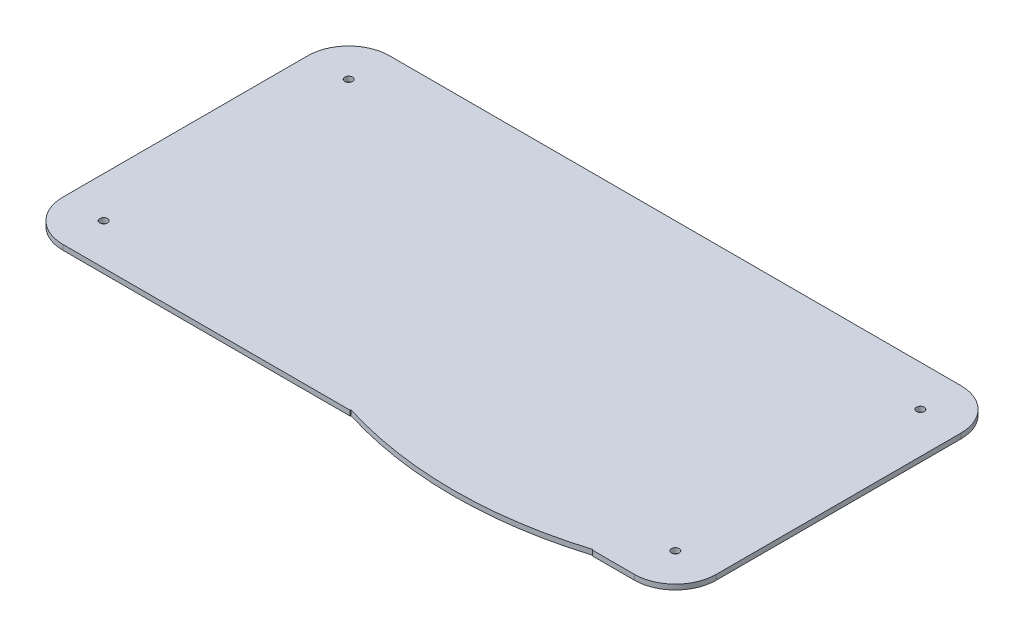
ISO-10303-21;
HEADER;
FILE_DESCRIPTION(('STEP AP214'),'2;1');
FILE_NAME('part.step','',(''),(''),'','','');
FILE_SCHEMA(('AUTOMOTIVE_DESIGN { 1 0 10303 214 1 1 1 1 }'));
ENDSEC;
DATA;
#1=APPLICATION_CONTEXT('core data for automotive mechanical design processes');
#2=APPLICATION_PROTOCOL_DEFINITION('international standard','automotive_design',2000,#1);
#3=PRODUCT_CONTEXT('',#1,'mechanical');
#4=PRODUCT('Part','Part','',(#3));
#5=PRODUCT_RELATED_PRODUCT_CATEGORY('part','',(#4));
#6=PRODUCT_DEFINITION_FORMATION('','',#4);
#7=PRODUCT_DEFINITION_CONTEXT('part definition',#1,'design');
#8=PRODUCT_DEFINITION('design','',#6,#7);
#9=PRODUCT_DEFINITION_SHAPE('','',#8);
#10=(LENGTH_UNIT() NAMED_UNIT(*) SI_UNIT(.MILLI.,.METRE.));
#11=(NAMED_UNIT(*) PLANE_ANGLE_UNIT() SI_UNIT($,.RADIAN.));
#12=(NAMED_UNIT(*) SI_UNIT($,.STERADIAN.) SOLID_ANGLE_UNIT());
#13=UNCERTAINTY_MEASURE_WITH_UNIT(LENGTH_MEASURE(1.E-05),#10,'distance_accuracy_value','');
#14=(GEOMETRIC_REPRESENTATION_CONTEXT(3) GLOBAL_UNCERTAINTY_ASSIGNED_CONTEXT((#13)) GLOBAL_UNIT_ASSIGNED_CONTEXT((#10,
#11,#12)) REPRESENTATION_CONTEXT('',''));
#15=CARTESIAN_POINT('',(0.,0.,0.));
#16=DIRECTION('',(0.,0.,1.));
#17=DIRECTION('',(1.,0.,0.));
#18=AXIS2_PLACEMENT_3D('',#15,#16,#17);
#19=CARTESIAN_POINT('',(-177.8,472.44,-25.4));
#20=DIRECTION('',(0.,1.,0.));
#21=DIRECTION('',(0.,0.,1.));
#22=AXIS2_PLACEMENT_3D('',#19,#20,#21);
#23=CYLINDRICAL_SURFACE('',#22,25.4);
#24=CARTESIAN_POINT('',(-177.8,478.79,-25.4));
#25=DIRECTION('',(0.,1.,0.));
#26=DIRECTION('',(0.,0.,1.));
#27=AXIS2_PLACEMENT_3D('',#24,#25,#26);
#28=CIRCLE('',#27,25.4);
#29=CARTESIAN_POINT('',(-203.2,478.79,-25.4));
#30=VERTEX_POINT('',#29);
#31=CARTESIAN_POINT('',(-177.8,478.79,0.));
#32=VERTEX_POINT('',#31);
#33=EDGE_CURVE('E180',#30,#32,#28,.T.);
#34=ORIENTED_EDGE('',*,*,#33,.F.);
#35=DIRECTION('',(0.,1.,0.));
#36=VECTOR('',#35,1.);
#37=CARTESIAN_POINT('',(-203.2,472.44,-25.4));
#38=LINE('',#37,#36);
#39=CARTESIAN_POINT('',(-203.2,475.615,-25.4));
#40=VERTEX_POINT('',#39);
#41=EDGE_CURVE('E202',#40,#30,#38,.T.);
#42=ORIENTED_EDGE('',*,*,#41,.F.);
#43=CARTESIAN_POINT('',(-177.8,475.615,-25.4));
#44=DIRECTION('',(0.,1.,0.));
#45=DIRECTION('',(0.,0.,1.));
#46=AXIS2_PLACEMENT_3D('',#43,#44,#45);
#47=CIRCLE('',#46,25.4);
#48=CARTESIAN_POINT('',(-177.8,475.615,0.));
#49=VERTEX_POINT('',#48);
#50=EDGE_CURVE('E201',#40,#49,#47,.T.);
#51=ORIENTED_EDGE('',*,*,#50,.T.);
#52=DIRECTION('',(0.,1.,0.));
#53=VECTOR('',#52,1.);
#54=CARTESIAN_POINT('',(-177.8,472.44,0.));
#55=LINE('',#54,#53);
#56=EDGE_CURVE('E215',#49,#32,#55,.T.);
#57=ORIENTED_EDGE('',*,*,#56,.T.);
#58=EDGE_LOOP('',(#34,#42,#51,#57));
#59=FACE_BOUND('',#58,.T.);
#60=ADVANCED_FACE('F36',(#59),#23,.T.);
#61=CARTESIAN_POINT('',(-203.2,472.44,-177.8));
#62=DIRECTION('',(-1.,0.,0.));
#63=DIRECTION('',(0.,0.,1.));
#64=AXIS2_PLACEMENT_3D('',#61,#62,#63);
#65=PLANE('',#64);
#66=DIRECTION('',(0.,0.,1.));
#67=VECTOR('',#66,1.);
#68=CARTESIAN_POINT('',(-203.2,478.79,-177.8));
#69=LINE('',#68,#67);
#70=CARTESIAN_POINT('',(-203.2,478.79,-177.8));
#71=VERTEX_POINT('',#70);
#72=EDGE_CURVE('E198',#71,#30,#69,.T.);
#73=ORIENTED_EDGE('',*,*,#72,.F.);
#74=DIRECTION('',(0.,1.,0.));
#75=VECTOR('',#74,1.);
#76=CARTESIAN_POINT('',(-203.2,472.44,-177.8));
#77=LINE('',#76,#75);
#78=CARTESIAN_POINT('',(-203.2,475.615,-177.8));
#79=VERTEX_POINT('',#78);
#80=EDGE_CURVE('E204',#79,#71,#77,.T.);
#81=ORIENTED_EDGE('',*,*,#80,.F.);
#82=DIRECTION('',(0.,0.,1.));
#83=VECTOR('',#82,1.);
#84=CARTESIAN_POINT('',(-203.2,475.615,-25.4));
#85=LINE('',#84,#83);
#86=EDGE_CURVE('E217',#79,#40,#85,.T.);
#87=ORIENTED_EDGE('',*,*,#86,.T.);
#88=ORIENTED_EDGE('',*,*,#41,.T.);
#89=EDGE_LOOP('',(#73,#81,#87,#88));
#90=FACE_BOUND('',#89,.T.);
#91=ADVANCED_FACE('F276',(#90),#65,.T.);
#92=CARTESIAN_POINT('',(-177.8,472.44,-177.8));
#93=DIRECTION('',(0.,1.,0.));
#94=DIRECTION('',(0.,0.,1.));
#95=AXIS2_PLACEMENT_3D('',#92,#93,#94);
#96=CYLINDRICAL_SURFACE('',#95,25.4);
#97=CARTESIAN_POINT('',(-177.8,478.79,-177.8));
#98=DIRECTION('',(0.,1.,0.));
#99=DIRECTION('',(0.,0.,1.));
#100=AXIS2_PLACEMENT_3D('',#97,#98,#99);
#101=CIRCLE('',#100,25.4);
#102=CARTESIAN_POINT('',(-177.8,478.79,-203.2));
#103=VERTEX_POINT('',#102);
#104=EDGE_CURVE('E195',#103,#71,#101,.T.);
#105=ORIENTED_EDGE('',*,*,#104,.F.);
#106=DIRECTION('',(0.,1.,0.));
#107=VECTOR('',#106,1.);
#108=CARTESIAN_POINT('',(-177.8,472.44,-203.2));
#109=LINE('',#108,#107);
#110=CARTESIAN_POINT('',(-177.8,475.615,-203.2));
#111=VERTEX_POINT('',#110);
#112=EDGE_CURVE('E206',#111,#103,#109,.T.);
#113=ORIENTED_EDGE('',*,*,#112,.F.);
#114=CARTESIAN_POINT('',(-177.8,475.615,-177.8));
#115=DIRECTION('',(0.,1.,0.));
#116=DIRECTION('',(0.,0.,1.));
#117=AXIS2_PLACEMENT_3D('',#114,#115,#116);
#118=CIRCLE('',#117,25.4);
#119=EDGE_CURVE('E218',#111,#79,#118,.T.);
#120=ORIENTED_EDGE('',*,*,#119,.T.);
#121=ORIENTED_EDGE('',*,*,#80,.T.);
#122=EDGE_LOOP('',(#105,#113,#120,#121));
#123=FACE_BOUND('',#122,.T.);
#124=ADVANCED_FACE('F280',(#123),#96,.T.);
#125=CARTESIAN_POINT('',(177.8,472.44,-203.2));
#126=DIRECTION('',(0.,0.,-1.));
#127=DIRECTION('',(-1.,0.,0.));
#128=AXIS2_PLACEMENT_3D('',#125,#126,#127);
#129=PLANE('',#128);
#130=DIRECTION('',(-1.,0.,0.));
#131=VECTOR('',#130,1.);
#132=CARTESIAN_POINT('',(177.8,478.79,-203.2));
#133=LINE('',#132,#131);
#134=CARTESIAN_POINT('',(177.8,478.79,-203.2));
#135=VERTEX_POINT('',#134);
#136=EDGE_CURVE('E192',#135,#103,#133,.T.);
#137=ORIENTED_EDGE('',*,*,#136,.F.);
#138=DIRECTION('',(0.,1.,0.));
#139=VECTOR('',#138,1.);
#140=CARTESIAN_POINT('',(177.8,472.44,-203.2));
#141=LINE('',#140,#139);
#142=CARTESIAN_POINT('',(177.8,475.615,-203.2));
#143=VERTEX_POINT('',#142);
#144=EDGE_CURVE('E208',#143,#135,#141,.T.);
#145=ORIENTED_EDGE('',*,*,#144,.F.);
#146=DIRECTION('',(-1.,0.,0.));
#147=VECTOR('',#146,1.);
#148=CARTESIAN_POINT('',(-177.8,475.615,-203.2));
#149=LINE('',#148,#147);
#150=EDGE_CURVE('E221',#143,#111,#149,.T.);
#151=ORIENTED_EDGE('',*,*,#150,.T.);
#152=ORIENTED_EDGE('',*,*,#112,.T.);
#153=EDGE_LOOP('',(#137,#145,#151,#152));
#154=FACE_BOUND('',#153,.T.);
#155=ADVANCED_FACE('F270',(#154),#129,.T.);
#156=CARTESIAN_POINT('',(177.8,472.44,-177.8));
#157=DIRECTION('',(0.,1.,0.));
#158=DIRECTION('',(0.,0.,1.));
#159=AXIS2_PLACEMENT_3D('',#156,#157,#158);
#160=CYLINDRICAL_SURFACE('',#159,25.4);
#161=CARTESIAN_POINT('',(177.8,478.79,-177.8));
#162=DIRECTION('',(0.,1.,0.));
#163=DIRECTION('',(0.,0.,1.));
#164=AXIS2_PLACEMENT_3D('',#161,#162,#163);
#165=CIRCLE('',#164,25.4);
#166=CARTESIAN_POINT('',(203.2,478.79,-177.8));
#167=VERTEX_POINT('',#166);
#168=EDGE_CURVE('E189',#167,#135,#165,.T.);
#169=ORIENTED_EDGE('',*,*,#168,.F.);
#170=DIRECTION('',(0.,1.,0.));
#171=VECTOR('',#170,1.);
#172=CARTESIAN_POINT('',(203.2,472.44,-177.8));
#173=LINE('',#172,#171);
#174=CARTESIAN_POINT('',(203.2,475.615,-177.8));
#175=VERTEX_POINT('',#174);
#176=EDGE_CURVE('E210',#175,#167,#173,.T.);
#177=ORIENTED_EDGE('',*,*,#176,.F.);
#178=CARTESIAN_POINT('',(177.8,475.615,-177.8));
#179=DIRECTION('',(0.,1.,0.));
#180=DIRECTION('',(0.,0.,1.));
#181=AXIS2_PLACEMENT_3D('',#178,#179,#180);
#182=CIRCLE('',#181,25.4);
#183=EDGE_CURVE('E235',#175,#143,#182,.T.);
#184=ORIENTED_EDGE('',*,*,#183,.T.);
#185=ORIENTED_EDGE('',*,*,#144,.T.);
#186=EDGE_LOOP('',(#169,#177,#184,#185));
#187=FACE_BOUND('',#186,.T.);
#188=ADVANCED_FACE('F266',(#187),#160,.T.);
#189=CARTESIAN_POINT('',(203.2,472.44,-25.4));
#190=DIRECTION('',(1.,0.,0.));
#191=DIRECTION('',(0.,0.,-1.));
#192=AXIS2_PLACEMENT_3D('',#189,#190,#191);
#193=PLANE('',#192);
#194=DIRECTION('',(0.,0.,-1.));
#195=VECTOR('',#194,1.);
#196=CARTESIAN_POINT('',(203.2,478.79,-25.4));
#197=LINE('',#196,#195);
#198=CARTESIAN_POINT('',(203.2,478.79,-25.4));
#199=VERTEX_POINT('',#198);
#200=EDGE_CURVE('E186',#199,#167,#197,.T.);
#201=ORIENTED_EDGE('',*,*,#200,.F.);
#202=DIRECTION('',(0.,1.,0.));
#203=VECTOR('',#202,1.);
#204=CARTESIAN_POINT('',(203.2,472.44,-25.4));
#205=LINE('',#204,#203);
#206=CARTESIAN_POINT('',(203.2,475.615,-25.4));
#207=VERTEX_POINT('',#206);
#208=EDGE_CURVE('E212',#207,#199,#205,.T.);
#209=ORIENTED_EDGE('',*,*,#208,.F.);
#210=DIRECTION('',(0.,0.,-1.));
#211=VECTOR('',#210,1.);
#212=CARTESIAN_POINT('',(203.2,475.615,-25.3999999999999));
#213=LINE('',#212,#211);
#214=EDGE_CURVE('E232',#207,#175,#213,.T.);
#215=ORIENTED_EDGE('',*,*,#214,.T.);
#216=ORIENTED_EDGE('',*,*,#176,.T.);
#217=EDGE_LOOP('',(#201,#209,#215,#216));
#218=FACE_BOUND('',#217,.T.);
#219=ADVANCED_FACE('F263',(#218),#193,.T.);
#220=CARTESIAN_POINT('',(177.8,472.44,-25.4));
#221=DIRECTION('',(0.,1.,0.));
#222=DIRECTION('',(0.,0.,1.));
#223=AXIS2_PLACEMENT_3D('',#220,#221,#222);
#224=CYLINDRICAL_SURFACE('',#223,25.4);
#225=CARTESIAN_POINT('',(177.8,478.79,-25.4));
#226=DIRECTION('',(0.,1.,0.));
#227=DIRECTION('',(0.,0.,1.));
#228=AXIS2_PLACEMENT_3D('',#225,#226,#227);
#229=CIRCLE('',#228,25.4);
#230=CARTESIAN_POINT('',(177.8,478.79,0.));
#231=VERTEX_POINT('',#230);
#232=EDGE_CURVE('E140',#231,#199,#229,.T.);
#233=ORIENTED_EDGE('',*,*,#232,.F.);
#234=DIRECTION('',(0.,1.,0.));
#235=VECTOR('',#234,1.);
#236=CARTESIAN_POINT('',(177.8,472.44,0.));
#237=LINE('',#236,#235);
#238=CARTESIAN_POINT('',(177.8,475.615,0.));
#239=VERTEX_POINT('',#238);
#240=EDGE_CURVE('E138',#239,#231,#237,.T.);
#241=ORIENTED_EDGE('',*,*,#240,.F.);
#242=CARTESIAN_POINT('',(177.8,475.615,-25.4));
#243=DIRECTION('',(0.,1.,0.));
#244=DIRECTION('',(0.,0.,1.));
#245=AXIS2_PLACEMENT_3D('',#242,#243,#244);
#246=CIRCLE('',#245,25.4);
#247=EDGE_CURVE('E229',#239,#207,#246,.T.);
#248=ORIENTED_EDGE('',*,*,#247,.T.);
#249=ORIENTED_EDGE('',*,*,#208,.T.);
#250=EDGE_LOOP('',(#233,#241,#248,#249));
#251=FACE_BOUND('',#250,.T.);
#252=ADVANCED_FACE('F259',(#251),#224,.T.);
#253=CARTESIAN_POINT('',(152.4,472.44,0.));
#254=DIRECTION('',(0.,0.,1.));
#255=DIRECTION('',(1.,0.,0.));
#256=AXIS2_PLACEMENT_3D('',#253,#254,#255);
#257=PLANE('',#256);
#258=DIRECTION('',(1.,0.,0.));
#259=VECTOR('',#258,1.);
#260=CARTESIAN_POINT('',(152.4,475.615,0.));
#261=LINE('',#260,#259);
#262=CARTESIAN_POINT('',(151.583380091741,475.615,0.));
#263=VERTEX_POINT('',#262);
#264=EDGE_CURVE('E228',#263,#239,#261,.T.);
#265=ORIENTED_EDGE('',*,*,#264,.T.);
#266=ORIENTED_EDGE('',*,*,#240,.T.);
#267=DIRECTION('',(1.,0.,0.));
#268=VECTOR('',#267,1.);
#269=CARTESIAN_POINT('',(-177.8,478.79,0.));
#270=LINE('',#269,#268);
#271=CARTESIAN_POINT('',(151.583380091741,478.79,0.));
#272=VERTEX_POINT('',#271);
#273=EDGE_CURVE('E127',#272,#231,#270,.T.);
#274=ORIENTED_EDGE('',*,*,#273,.F.);
#275=DIRECTION('',(0.,1.,0.));
#276=VECTOR('',#275,1.);
#277=CARTESIAN_POINT('',(151.583380091741,472.824934620479,0.));
#278=LINE('',#277,#276);
#279=EDGE_CURVE('E132',#263,#272,#278,.T.);
#280=ORIENTED_EDGE('',*,*,#279,.F.);
#281=EDGE_LOOP('',(#265,#266,#274,#280));
#282=FACE_BOUND('',#281,.T.);
#283=ADVANCED_FACE('F136',(#282),#257,.T.);
#284=CARTESIAN_POINT('',(-177.8,472.44,0.));
#285=DIRECTION('',(0.,0.,1.));
#286=DIRECTION('',(1.,0.,0.));
#287=AXIS2_PLACEMENT_3D('',#284,#285,#286);
#288=PLANE('',#287);
#289=DIRECTION('',(1.,0.,0.));
#290=VECTOR('',#289,1.);
#291=CARTESIAN_POINT('',(-177.8,475.615,0.));
#292=LINE('',#291,#290);
#293=CARTESIAN_POINT('',(0.80427456169157,475.615,0.));
#294=VERTEX_POINT('',#293);
#295=EDGE_CURVE('E226',#49,#294,#292,.T.);
#296=ORIENTED_EDGE('',*,*,#295,.T.);
#297=DIRECTION('',(0.,1.,0.));
#298=VECTOR('',#297,1.);
#299=CARTESIAN_POINT('',(0.80427456169157,472.824934620479,0.));
#300=LINE('',#299,#298);
#301=CARTESIAN_POINT('',(0.80427456169157,478.79,0.));
#302=VERTEX_POINT('',#301);
#303=EDGE_CURVE('E153',#294,#302,#300,.T.);
#304=ORIENTED_EDGE('',*,*,#303,.T.);
#305=DIRECTION('',(1.,0.,0.));
#306=VECTOR('',#305,1.);
#307=CARTESIAN_POINT('',(-177.8,478.79,0.));
#308=LINE('',#307,#306);
#309=EDGE_CURVE('E141',#32,#302,#308,.T.);
#310=ORIENTED_EDGE('',*,*,#309,.F.);
#311=ORIENTED_EDGE('',*,*,#56,.F.);
#312=EDGE_LOOP('',(#296,#304,#310,#311));
#313=FACE_BOUND('',#312,.T.);
#314=ADVANCED_FACE('F250',(#313),#288,.T.);
#315=CARTESIAN_POINT('',(-177.8,475.615,-25.4));
#316=DIRECTION('',(0.,1.,0.));
#317=DIRECTION('',(0.,0.,1.));
#318=AXIS2_PLACEMENT_3D('',#315,#316,#317);
#319=PLANE('',#318);
#320=DIRECTION('',(-0.297114446103736,0.,-0.954841874823507));
#321=VECTOR('',#320,1.);
#322=CARTESIAN_POINT('',(151.201921547921,475.615,-1.22589997196476));
#323=LINE('',#322,#321);
#324=CARTESIAN_POINT('',(151.429412484423,475.615,-0.494808383642659));
#325=VERTEX_POINT('',#324);
#326=EDGE_CURVE('E144',#263,#325,#323,.T.);
#327=ORIENTED_EDGE('',*,*,#326,.T.);
#328=CARTESIAN_POINT('',(76.2,475.615,-242.300557159904));
#329=DIRECTION('',(0.,1.,0.));
#330=DIRECTION('',(0.,0.,1.));
#331=AXIS2_PLACEMENT_3D('',#328,#329,#330);
#332=CIRCLE('',#331,253.238);
#333=CARTESIAN_POINT('',(0.959331897580934,475.615,-0.498310463349333));
#334=VERTEX_POINT('',#333);
#335=EDGE_CURVE('E183',#325,#334,#332,.F.);
#336=ORIENTED_EDGE('',*,*,#335,.T.);
#337=DIRECTION('',(-0.29711444610374,0.,0.954841874823506));
#338=VECTOR('',#337,1.);
#339=CARTESIAN_POINT('',(1.18573310551195,475.615,-1.22589997196476));
#340=LINE('',#339,#338);
#341=EDGE_CURVE('E149',#334,#294,#340,.T.);
#342=ORIENTED_EDGE('',*,*,#341,.T.);
#343=ORIENTED_EDGE('',*,*,#295,.F.);
#344=ORIENTED_EDGE('',*,*,#50,.F.);
#345=ORIENTED_EDGE('',*,*,#86,.F.);
#346=ORIENTED_EDGE('',*,*,#119,.F.);
#347=ORIENTED_EDGE('',*,*,#150,.F.);
#348=ORIENTED_EDGE('',*,*,#183,.F.);
#349=ORIENTED_EDGE('',*,*,#214,.F.);
#350=ORIENTED_EDGE('',*,*,#247,.F.);
#351=ORIENTED_EDGE('',*,*,#264,.F.);
#352=EDGE_LOOP('',(#327,#336,#342,#343,#344,#345,#346,#347,#348,#349,#350,#351));
#353=FACE_BOUND('',#352,.T.);
#354=CARTESIAN_POINT('',(177.8,475.615,-25.4));
#355=DIRECTION('',(0.,1.,0.));
#356=DIRECTION('',(0.,0.,1.));
#357=AXIS2_PLACEMENT_3D('',#354,#355,#356);
#358=CIRCLE('',#357,2.413);
#359=CARTESIAN_POINT('',(177.8,475.615,-22.987));
#360=VERTEX_POINT('',#359);
#361=EDGE_CURVE('E159',#360,#360,#358,.T.);
#362=ORIENTED_EDGE('',*,*,#361,.T.);
#363=EDGE_LOOP('',(#362));
#364=FACE_BOUND('',#363,.T.);
#365=CARTESIAN_POINT('',(177.8,475.615,-177.8));
#366=DIRECTION('',(0.,1.,0.));
#367=DIRECTION('',(0.,0.,1.));
#368=AXIS2_PLACEMENT_3D('',#365,#366,#367);
#369=CIRCLE('',#368,2.413);
#370=CARTESIAN_POINT('',(177.8,475.615,-175.387));
#371=VERTEX_POINT('',#370);
#372=EDGE_CURVE('E165',#371,#371,#369,.T.);
#373=ORIENTED_EDGE('',*,*,#372,.T.);
#374=EDGE_LOOP('',(#373));
#375=FACE_BOUND('',#374,.T.);
#376=CARTESIAN_POINT('',(-177.8,475.615,-25.4));
#377=DIRECTION('',(0.,1.,0.));
#378=DIRECTION('',(0.,0.,1.));
#379=AXIS2_PLACEMENT_3D('',#376,#377,#378);
#380=CIRCLE('',#379,2.413);
#381=CARTESIAN_POINT('',(-177.8,475.615,-22.987));
#382=VERTEX_POINT('',#381);
#383=EDGE_CURVE('E171',#382,#382,#380,.T.);
#384=ORIENTED_EDGE('',*,*,#383,.T.);
#385=EDGE_LOOP('',(#384));
#386=FACE_BOUND('',#385,.T.);
#387=CARTESIAN_POINT('',(-177.8,475.615,-177.8));
#388=DIRECTION('',(0.,1.,0.));
#389=DIRECTION('',(0.,0.,1.));
#390=AXIS2_PLACEMENT_3D('',#387,#388,#389);
#391=CIRCLE('',#390,2.413);
#392=CARTESIAN_POINT('',(-177.8,475.615,-175.387));
#393=VERTEX_POINT('',#392);
#394=EDGE_CURVE('E177',#393,#393,#391,.T.);
#395=ORIENTED_EDGE('',*,*,#394,.T.);
#396=EDGE_LOOP('',(#395));
#397=FACE_BOUND('',#396,.T.);
#398=ADVANCED_FACE('F254',(#353,#364,#375,#386,#397),#319,.F.);
#399=CARTESIAN_POINT('',(-177.8,478.79,-25.4));
#400=DIRECTION('',(0.,1.,0.));
#401=DIRECTION('',(0.,0.,1.));
#402=AXIS2_PLACEMENT_3D('',#399,#400,#401);
#403=PLANE('',#402);
#404=CARTESIAN_POINT('',(76.2,478.79,-242.300557159904));
#405=DIRECTION('',(0.,1.,0.));
#406=DIRECTION('',(0.,0.,1.));
#407=AXIS2_PLACEMENT_3D('',#404,#405,#406);
#408=CIRCLE('',#407,253.238);
#409=CARTESIAN_POINT('',(151.429412484423,478.79,-0.494808383642686));
#410=VERTEX_POINT('',#409);
#411=CARTESIAN_POINT('',(0.95933189758092,478.79,-0.498310463349305));
#412=VERTEX_POINT('',#411);
#413=EDGE_CURVE('E130',#410,#412,#408,.F.);
#414=ORIENTED_EDGE('',*,*,#413,.F.);
#415=DIRECTION('',(0.297114446103736,0.,0.954841874823507));
#416=VECTOR('',#415,1.);
#417=CARTESIAN_POINT('',(151.201921547921,478.79,-1.22589997196476));
#418=LINE('',#417,#416);
#419=EDGE_CURVE('E122',#410,#272,#418,.T.);
#420=ORIENTED_EDGE('',*,*,#419,.T.);
#421=ORIENTED_EDGE('',*,*,#273,.T.);
#422=ORIENTED_EDGE('',*,*,#232,.T.);
#423=ORIENTED_EDGE('',*,*,#200,.T.);
#424=ORIENTED_EDGE('',*,*,#168,.T.);
#425=ORIENTED_EDGE('',*,*,#136,.T.);
#426=ORIENTED_EDGE('',*,*,#104,.T.);
#427=ORIENTED_EDGE('',*,*,#72,.T.);
#428=ORIENTED_EDGE('',*,*,#33,.T.);
#429=ORIENTED_EDGE('',*,*,#309,.T.);
#430=DIRECTION('',(0.29711444610374,0.,-0.954841874823506));
#431=VECTOR('',#430,1.);
#432=CARTESIAN_POINT('',(1.18573310551195,478.79,-1.22589997196476));
#433=LINE('',#432,#431);
#434=EDGE_CURVE('E146',#302,#412,#433,.T.);
#435=ORIENTED_EDGE('',*,*,#434,.T.);
#436=EDGE_LOOP('',(#414,#420,#421,#422,#423,#424,#425,#426,#427,#428,#429,#435));
#437=FACE_BOUND('',#436,.T.);
#438=CARTESIAN_POINT('',(177.8,478.79,-25.4));
#439=DIRECTION('',(0.,1.,0.));
#440=DIRECTION('',(0.,0.,1.));
#441=AXIS2_PLACEMENT_3D('',#438,#439,#440);
#442=CIRCLE('',#441,2.413);
#443=CARTESIAN_POINT('',(177.8,478.79,-22.987));
#444=VERTEX_POINT('',#443);
#445=EDGE_CURVE('E152',#444,#444,#442,.T.);
#446=ORIENTED_EDGE('',*,*,#445,.F.);
#447=EDGE_LOOP('',(#446));
#448=FACE_BOUND('',#447,.T.);
#449=CARTESIAN_POINT('',(177.8,478.79,-177.8));
#450=DIRECTION('',(0.,1.,0.));
#451=DIRECTION('',(0.,0.,1.));
#452=AXIS2_PLACEMENT_3D('',#449,#450,#451);
#453=CIRCLE('',#452,2.413);
#454=CARTESIAN_POINT('',(177.8,478.79,-175.387));
#455=VERTEX_POINT('',#454);
#456=EDGE_CURVE('E162',#455,#455,#453,.T.);
#457=ORIENTED_EDGE('',*,*,#456,.F.);
#458=EDGE_LOOP('',(#457));
#459=FACE_BOUND('',#458,.T.);
#460=CARTESIAN_POINT('',(-177.8,478.79,-25.4));
#461=DIRECTION('',(0.,1.,0.));
#462=DIRECTION('',(0.,0.,1.));
#463=AXIS2_PLACEMENT_3D('',#460,#461,#462);
#464=CIRCLE('',#463,2.413);
#465=CARTESIAN_POINT('',(-177.8,478.79,-22.987));
#466=VERTEX_POINT('',#465);
#467=EDGE_CURVE('E168',#466,#466,#464,.T.);
#468=ORIENTED_EDGE('',*,*,#467,.F.);
#469=EDGE_LOOP('',(#468));
#470=FACE_BOUND('',#469,.T.);
#471=CARTESIAN_POINT('',(-177.8,478.79,-177.8));
#472=DIRECTION('',(0.,1.,0.));
#473=DIRECTION('',(0.,0.,1.));
#474=AXIS2_PLACEMENT_3D('',#471,#472,#473);
#475=CIRCLE('',#474,2.413);
#476=CARTESIAN_POINT('',(-177.8,478.79,-175.387));
#477=VERTEX_POINT('',#476);
#478=EDGE_CURVE('E174',#477,#477,#475,.T.);
#479=ORIENTED_EDGE('',*,*,#478,.F.);
#480=EDGE_LOOP('',(#479));
#481=FACE_BOUND('',#480,.T.);
#482=ADVANCED_FACE('F124',(#437,#448,#459,#470,#481),#403,.T.);
#483=CARTESIAN_POINT('',(76.2,471.17,-242.300557159904));
#484=DIRECTION('',(0.,1.,0.));
#485=DIRECTION('',(0.,0.,1.));
#486=AXIS2_PLACEMENT_3D('',#483,#484,#485);
#487=CYLINDRICAL_SURFACE('',#486,253.238);
#488=ORIENTED_EDGE('',*,*,#335,.F.);
#489=DIRECTION('',(0.,1.,0.));
#490=VECTOR('',#489,1.);
#491=CARTESIAN_POINT('',(151.429412484423,471.17,-0.494808383642714));
#492=LINE('',#491,#490);
#493=EDGE_CURVE('E12',#325,#410,#492,.T.);
#494=ORIENTED_EDGE('',*,*,#493,.T.);
#495=ORIENTED_EDGE('',*,*,#413,.T.);
#496=DIRECTION('',(0.,1.,0.));
#497=VECTOR('',#496,1.);
#498=CARTESIAN_POINT('',(0.95933189758092,471.17,-0.498310463349333));
#499=LINE('',#498,#497);
#500=EDGE_CURVE('E44',#412,#334,#499,.F.);
#501=ORIENTED_EDGE('',*,*,#500,.T.);
#502=EDGE_LOOP('',(#488,#494,#495,#501));
#503=FACE_BOUND('',#502,.T.);
#504=ADVANCED_FACE('F38',(#503),#487,.T.);
#505=CARTESIAN_POINT('',(-177.8,468.63,-177.8));
#506=DIRECTION('',(0.,1.,0.));
#507=DIRECTION('',(0.,0.,1.));
#508=AXIS2_PLACEMENT_3D('',#505,#506,#507);
#509=CYLINDRICAL_SURFACE('',#508,2.413);
#510=ORIENTED_EDGE('',*,*,#478,.T.);
#511=EDGE_LOOP('',(#510));
#512=FACE_BOUND('',#511,.T.);
#513=ORIENTED_EDGE('',*,*,#394,.F.);
#514=EDGE_LOOP('',(#513));
#515=FACE_BOUND('',#514,.T.);
#516=ADVANCED_FACE('F364',(#512,#515),#509,.F.);
#517=CARTESIAN_POINT('',(-177.8,468.63,-25.4));
#518=DIRECTION('',(0.,1.,0.));
#519=DIRECTION('',(0.,0.,1.));
#520=AXIS2_PLACEMENT_3D('',#517,#518,#519);
#521=CYLINDRICAL_SURFACE('',#520,2.413);
#522=ORIENTED_EDGE('',*,*,#467,.T.);
#523=EDGE_LOOP('',(#522));
#524=FACE_BOUND('',#523,.T.);
#525=ORIENTED_EDGE('',*,*,#383,.F.);
#526=EDGE_LOOP('',(#525));
#527=FACE_BOUND('',#526,.T.);
#528=ADVANCED_FACE('F373',(#524,#527),#521,.F.);
#529=CARTESIAN_POINT('',(177.8,468.63,-177.8));
#530=DIRECTION('',(0.,1.,0.));
#531=DIRECTION('',(0.,0.,1.));
#532=AXIS2_PLACEMENT_3D('',#529,#530,#531);
#533=CYLINDRICAL_SURFACE('',#532,2.413);
#534=ORIENTED_EDGE('',*,*,#456,.T.);
#535=EDGE_LOOP('',(#534));
#536=FACE_BOUND('',#535,.T.);
#537=ORIENTED_EDGE('',*,*,#372,.F.);
#538=EDGE_LOOP('',(#537));
#539=FACE_BOUND('',#538,.T.);
#540=ADVANCED_FACE('F382',(#536,#539),#533,.F.);
#541=CARTESIAN_POINT('',(177.8,468.63,-25.4));
#542=DIRECTION('',(0.,1.,0.));
#543=DIRECTION('',(0.,0.,1.));
#544=AXIS2_PLACEMENT_3D('',#541,#542,#543);
#545=CYLINDRICAL_SURFACE('',#544,2.413);
#546=ORIENTED_EDGE('',*,*,#445,.T.);
#547=EDGE_LOOP('',(#546));
#548=FACE_BOUND('',#547,.T.);
#549=ORIENTED_EDGE('',*,*,#361,.F.);
#550=EDGE_LOOP('',(#549));
#551=FACE_BOUND('',#550,.T.);
#552=ADVANCED_FACE('F390',(#548,#551),#545,.F.);
#553=CARTESIAN_POINT('',(1.18573310551195,472.824934620479,-1.22589997196476));
#554=DIRECTION('',(0.954841874823506,0.,0.29711444610374));
#555=DIRECTION('',(0.29711444610374,0.,-0.954841874823506));
#556=AXIS2_PLACEMENT_3D('',#553,#554,#555);
#557=PLANE('',#556);
#558=ORIENTED_EDGE('',*,*,#341,.F.);
#559=ORIENTED_EDGE('',*,*,#500,.F.);
#560=ORIENTED_EDGE('',*,*,#434,.F.);
#561=ORIENTED_EDGE('',*,*,#303,.F.);
#562=EDGE_LOOP('',(#558,#559,#560,#561));
#563=FACE_BOUND('',#562,.T.);
#564=ADVANCED_FACE('F245',(#563),#557,.T.);
#565=CARTESIAN_POINT('',(151.201921547921,472.824934620479,-1.22589997196476));
#566=DIRECTION('',(-0.954841874823507,0.,0.297114446103736));
#567=DIRECTION('',(0.297114446103736,0.,0.954841874823507));
#568=AXIS2_PLACEMENT_3D('',#565,#566,#567);
#569=PLANE('',#568);
#570=ORIENTED_EDGE('',*,*,#493,.F.);
#571=ORIENTED_EDGE('',*,*,#326,.F.);
#572=ORIENTED_EDGE('',*,*,#279,.T.);
#573=ORIENTED_EDGE('',*,*,#419,.F.);
#574=EDGE_LOOP('',(#570,#571,#572,#573));
#575=FACE_BOUND('',#574,.T.);
#576=ADVANCED_FACE('F143',(#575),#569,.T.);
#577=CLOSED_SHELL('',(#60,#91,#124,#155,#188,#219,#252,#283,#314,#398,#482,#504,#516,#528,#540,
#552,#564,#576));
#578=MANIFOLD_SOLID_BREP('B2',#577);
#579=ADVANCED_BREP_SHAPE_REPRESENTATION('',(#18,#578),#14);
#580=SHAPE_DEFINITION_REPRESENTATION(#9,#579);
ENDSEC;
END-ISO-10303-21;
